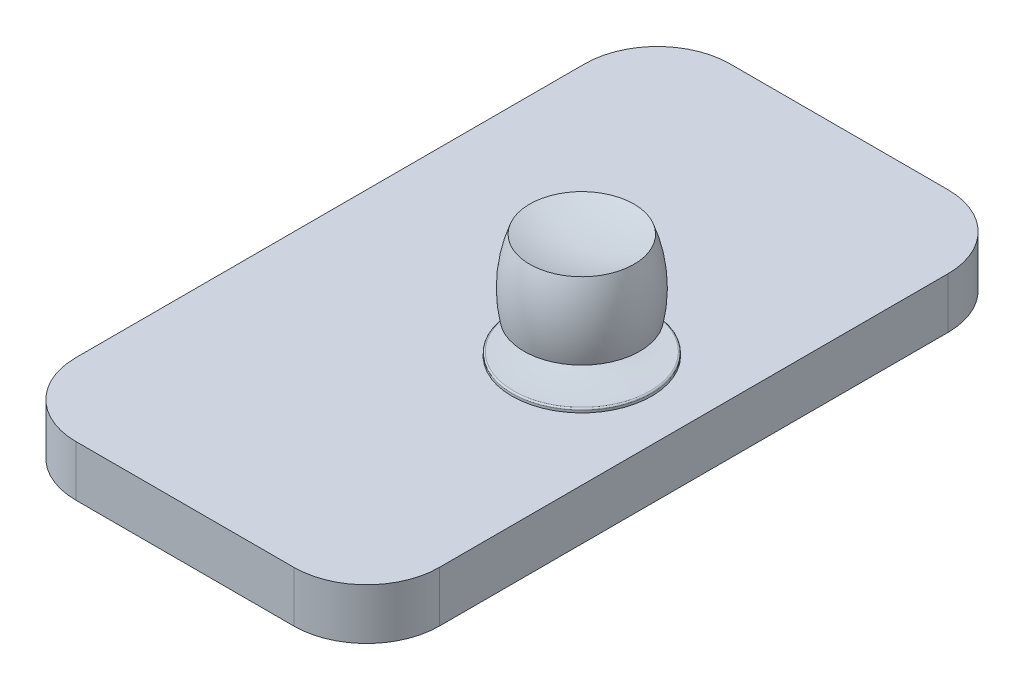
ISO-10303-21;
HEADER;
FILE_DESCRIPTION(('STEP AP214'),'2;1');
FILE_NAME('part.step','',(''),(''),'','','');
FILE_SCHEMA(('AUTOMOTIVE_DESIGN { 1 0 10303 214 1 1 1 1 }'));
ENDSEC;
DATA;
#1=APPLICATION_CONTEXT('core data for automotive mechanical design processes');
#2=APPLICATION_PROTOCOL_DEFINITION('international standard','automotive_design',2000,#1);
#3=PRODUCT_CONTEXT('',#1,'mechanical');
#4=PRODUCT('Part','Part','',(#3));
#5=PRODUCT_RELATED_PRODUCT_CATEGORY('part','',(#4));
#6=PRODUCT_DEFINITION_FORMATION('','',#4);
#7=PRODUCT_DEFINITION_CONTEXT('part definition',#1,'design');
#8=PRODUCT_DEFINITION('design','',#6,#7);
#9=PRODUCT_DEFINITION_SHAPE('','',#8);
#10=(LENGTH_UNIT() NAMED_UNIT(*) SI_UNIT(.MILLI.,.METRE.));
#11=(NAMED_UNIT(*) PLANE_ANGLE_UNIT() SI_UNIT($,.RADIAN.));
#12=(NAMED_UNIT(*) SI_UNIT($,.STERADIAN.) SOLID_ANGLE_UNIT());
#13=UNCERTAINTY_MEASURE_WITH_UNIT(LENGTH_MEASURE(1.E-05),#10,'distance_accuracy_value','');
#14=(GEOMETRIC_REPRESENTATION_CONTEXT(3) GLOBAL_UNCERTAINTY_ASSIGNED_CONTEXT((#13)) GLOBAL_UNIT_ASSIGNED_CONTEXT((#10,
#11,#12)) REPRESENTATION_CONTEXT('',''));
#15=CARTESIAN_POINT('',(0.,0.,0.));
#16=DIRECTION('',(0.,0.,1.));
#17=DIRECTION('',(1.,0.,0.));
#18=AXIS2_PLACEMENT_3D('',#15,#16,#17);
#19=CARTESIAN_POINT('',(63.5,17.78,-114.3));
#20=DIRECTION('',(-1.,0.,0.));
#21=DIRECTION('',(0.,0.,1.));
#22=AXIS2_PLACEMENT_3D('',#19,#20,#21);
#23=PLANE('',#22);
#24=DIRECTION('',(0.,0.,-1.));
#25=VECTOR('',#24,1.);
#26=CARTESIAN_POINT('',(63.5,0.,-114.3));
#27=LINE('',#26,#25);
#28=CARTESIAN_POINT('',(63.5,0.,88.9));
#29=VERTEX_POINT('',#28);
#30=CARTESIAN_POINT('',(63.5,0.,-88.9));
#31=VERTEX_POINT('',#30);
#32=EDGE_CURVE('E129',#29,#31,#27,.T.);
#33=ORIENTED_EDGE('',*,*,#32,.T.);
#34=DIRECTION('',(0.,-1.,0.));
#35=VECTOR('',#34,1.);
#36=CARTESIAN_POINT('',(63.5,17.78,-88.9));
#37=LINE('',#36,#35);
#38=CARTESIAN_POINT('',(63.5,17.78,-88.9));
#39=VERTEX_POINT('',#38);
#40=EDGE_CURVE('E43',#31,#39,#37,.F.);
#41=ORIENTED_EDGE('',*,*,#40,.T.);
#42=DIRECTION('',(0.,0.,-1.));
#43=VECTOR('',#42,1.);
#44=CARTESIAN_POINT('',(63.5,17.78,-114.3));
#45=LINE('',#44,#43);
#46=CARTESIAN_POINT('',(63.5,17.78,88.9));
#47=VERTEX_POINT('',#46);
#48=EDGE_CURVE('E130',#47,#39,#45,.T.);
#49=ORIENTED_EDGE('',*,*,#48,.F.);
#50=DIRECTION('',(0.,-1.,0.));
#51=VECTOR('',#50,1.);
#52=CARTESIAN_POINT('',(63.5,17.78,88.9));
#53=LINE('',#52,#51);
#54=EDGE_CURVE('E179',#47,#29,#53,.T.);
#55=ORIENTED_EDGE('',*,*,#54,.T.);
#56=EDGE_LOOP('',(#33,#41,#49,#55));
#57=FACE_BOUND('',#56,.T.);
#58=ADVANCED_FACE('F35',(#57),#23,.F.);
#59=CARTESIAN_POINT('',(-63.5,17.78,-114.3));
#60=DIRECTION('',(0.,0.,1.));
#61=DIRECTION('',(1.,0.,0.));
#62=AXIS2_PLACEMENT_3D('',#59,#60,#61);
#63=PLANE('',#62);
#64=DIRECTION('',(-1.,0.,0.));
#65=VECTOR('',#64,1.);
#66=CARTESIAN_POINT('',(-63.5,0.,-114.3));
#67=LINE('',#66,#65);
#68=CARTESIAN_POINT('',(38.1,0.,-114.3));
#69=VERTEX_POINT('',#68);
#70=CARTESIAN_POINT('',(-38.1,0.,-114.3));
#71=VERTEX_POINT('',#70);
#72=EDGE_CURVE('E144',#69,#71,#67,.T.);
#73=ORIENTED_EDGE('',*,*,#72,.T.);
#74=DIRECTION('',(0.,-1.,0.));
#75=VECTOR('',#74,1.);
#76=CARTESIAN_POINT('',(-38.1,17.78,-114.3));
#77=LINE('',#76,#75);
#78=CARTESIAN_POINT('',(-38.1,17.78,-114.3));
#79=VERTEX_POINT('',#78);
#80=EDGE_CURVE('E50',#71,#79,#77,.F.);
#81=ORIENTED_EDGE('',*,*,#80,.T.);
#82=DIRECTION('',(-1.,0.,0.));
#83=VECTOR('',#82,1.);
#84=CARTESIAN_POINT('',(-63.5,17.78,-114.3));
#85=LINE('',#84,#83);
#86=CARTESIAN_POINT('',(38.1,17.78,-114.3));
#87=VERTEX_POINT('',#86);
#88=EDGE_CURVE('E132',#87,#79,#85,.T.);
#89=ORIENTED_EDGE('',*,*,#88,.F.);
#90=DIRECTION('',(0.,-1.,0.));
#91=VECTOR('',#90,1.);
#92=CARTESIAN_POINT('',(38.1,17.78,-114.3));
#93=LINE('',#92,#91);
#94=EDGE_CURVE('E175',#87,#69,#93,.T.);
#95=ORIENTED_EDGE('',*,*,#94,.T.);
#96=EDGE_LOOP('',(#73,#81,#89,#95));
#97=FACE_BOUND('',#96,.T.);
#98=ADVANCED_FACE('F192',(#97),#63,.F.);
#99=CARTESIAN_POINT('',(-63.5,17.78,-114.3));
#100=DIRECTION('',(1.,0.,0.));
#101=DIRECTION('',(0.,0.,-1.));
#102=AXIS2_PLACEMENT_3D('',#99,#100,#101);
#103=PLANE('',#102);
#104=DIRECTION('',(0.,0.,1.));
#105=VECTOR('',#104,1.);
#106=CARTESIAN_POINT('',(-63.5,0.,-114.3));
#107=LINE('',#106,#105);
#108=CARTESIAN_POINT('',(-63.5,0.,-88.9));
#109=VERTEX_POINT('',#108);
#110=CARTESIAN_POINT('',(-63.5,0.,88.9));
#111=VERTEX_POINT('',#110);
#112=EDGE_CURVE('E146',#109,#111,#107,.T.);
#113=ORIENTED_EDGE('',*,*,#112,.T.);
#114=DIRECTION('',(0.,-1.,0.));
#115=VECTOR('',#114,1.);
#116=CARTESIAN_POINT('',(-63.5,17.78,88.9));
#117=LINE('',#116,#115);
#118=CARTESIAN_POINT('',(-63.5,17.78,88.9));
#119=VERTEX_POINT('',#118);
#120=EDGE_CURVE('E166',#111,#119,#117,.F.);
#121=ORIENTED_EDGE('',*,*,#120,.T.);
#122=DIRECTION('',(0.,0.,1.));
#123=VECTOR('',#122,1.);
#124=CARTESIAN_POINT('',(-63.5,17.78,-114.3));
#125=LINE('',#124,#123);
#126=CARTESIAN_POINT('',(-63.5,17.78,-88.9));
#127=VERTEX_POINT('',#126);
#128=EDGE_CURVE('E135',#127,#119,#125,.T.);
#129=ORIENTED_EDGE('',*,*,#128,.F.);
#130=DIRECTION('',(0.,-1.,0.));
#131=VECTOR('',#130,1.);
#132=CARTESIAN_POINT('',(-63.5,17.78,-88.9));
#133=LINE('',#132,#131);
#134=EDGE_CURVE('E163',#127,#109,#133,.T.);
#135=ORIENTED_EDGE('',*,*,#134,.T.);
#136=EDGE_LOOP('',(#113,#121,#129,#135));
#137=FACE_BOUND('',#136,.T.);
#138=ADVANCED_FACE('F203',(#137),#103,.F.);
#139=CARTESIAN_POINT('',(-63.5,17.78,114.3));
#140=DIRECTION('',(0.,0.,-1.));
#141=DIRECTION('',(-1.,0.,0.));
#142=AXIS2_PLACEMENT_3D('',#139,#140,#141);
#143=PLANE('',#142);
#144=DIRECTION('',(1.,0.,0.));
#145=VECTOR('',#144,1.);
#146=CARTESIAN_POINT('',(-63.5,17.78,114.3));
#147=LINE('',#146,#145);
#148=CARTESIAN_POINT('',(-38.1,17.78,114.3));
#149=VERTEX_POINT('',#148);
#150=CARTESIAN_POINT('',(38.1,17.78,114.3));
#151=VERTEX_POINT('',#150);
#152=EDGE_CURVE('E138',#149,#151,#147,.T.);
#153=ORIENTED_EDGE('',*,*,#152,.F.);
#154=DIRECTION('',(0.,-1.,0.));
#155=VECTOR('',#154,1.);
#156=CARTESIAN_POINT('',(-38.1,17.78,114.3));
#157=LINE('',#156,#155);
#158=CARTESIAN_POINT('',(-38.1,0.,114.3));
#159=VERTEX_POINT('',#158);
#160=EDGE_CURVE('E152',#149,#159,#157,.T.);
#161=ORIENTED_EDGE('',*,*,#160,.T.);
#162=DIRECTION('',(1.,0.,0.));
#163=VECTOR('',#162,1.);
#164=CARTESIAN_POINT('',(-63.5,0.,114.3));
#165=LINE('',#164,#163);
#166=CARTESIAN_POINT('',(38.1,0.,114.3));
#167=VERTEX_POINT('',#166);
#168=EDGE_CURVE('E133',#159,#167,#165,.T.);
#169=ORIENTED_EDGE('',*,*,#168,.T.);
#170=DIRECTION('',(0.,-1.,0.));
#171=VECTOR('',#170,1.);
#172=CARTESIAN_POINT('',(38.1,17.78,114.3));
#173=LINE('',#172,#171);
#174=EDGE_CURVE('E141',#167,#151,#173,.F.);
#175=ORIENTED_EDGE('',*,*,#174,.T.);
#176=EDGE_LOOP('',(#153,#161,#169,#175));
#177=FACE_BOUND('',#176,.T.);
#178=ADVANCED_FACE('F211',(#177),#143,.F.);
#179=CARTESIAN_POINT('',(0.,17.78,0.));
#180=DIRECTION('',(0.,1.,0.));
#181=DIRECTION('',(0.,0.,1.));
#182=AXIS2_PLACEMENT_3D('',#179,#180,#181);
#183=PLANE('',#182);
#184=CARTESIAN_POINT('',(24.4007110677409,17.78,0.));
#185=DIRECTION('',(0.,1.,0.));
#186=DIRECTION('',(0.,0.,1.));
#187=AXIS2_PLACEMENT_3D('',#184,#185,#186);
#188=CIRCLE('',#187,24.4007110677409);
#189=CARTESIAN_POINT('',(24.4007110677409,17.78,24.4007110677409));
#190=VERTEX_POINT('',#189);
#191=EDGE_CURVE('E115',#190,#190,#188,.T.);
#192=ORIENTED_EDGE('',*,*,#191,.F.);
#193=EDGE_LOOP('',(#192));
#194=FACE_BOUND('',#193,.T.);
#195=ORIENTED_EDGE('',*,*,#128,.T.);
#196=CARTESIAN_POINT('',(-38.1,17.78,88.9));
#197=DIRECTION('',(0.,1.,0.));
#198=DIRECTION('',(0.,0.,1.));
#199=AXIS2_PLACEMENT_3D('',#196,#197,#198);
#200=CIRCLE('',#199,25.4);
#201=EDGE_CURVE('E173',#119,#149,#200,.T.);
#202=ORIENTED_EDGE('',*,*,#201,.T.);
#203=ORIENTED_EDGE('',*,*,#152,.T.);
#204=CARTESIAN_POINT('',(38.1,17.78,88.9));
#205=DIRECTION('',(0.,1.,0.));
#206=DIRECTION('',(0.,0.,1.));
#207=AXIS2_PLACEMENT_3D('',#204,#205,#206);
#208=CIRCLE('',#207,25.4);
#209=EDGE_CURVE('E168',#151,#47,#208,.T.);
#210=ORIENTED_EDGE('',*,*,#209,.T.);
#211=ORIENTED_EDGE('',*,*,#48,.T.);
#212=CARTESIAN_POINT('',(38.1,17.78,-88.9));
#213=DIRECTION('',(0.,1.,0.));
#214=DIRECTION('',(0.,0.,1.));
#215=AXIS2_PLACEMENT_3D('',#212,#213,#214);
#216=CIRCLE('',#215,25.4);
#217=EDGE_CURVE('E57',#39,#87,#216,.T.);
#218=ORIENTED_EDGE('',*,*,#217,.T.);
#219=ORIENTED_EDGE('',*,*,#88,.T.);
#220=CARTESIAN_POINT('',(-38.1,17.78,-88.9));
#221=DIRECTION('',(0.,1.,0.));
#222=DIRECTION('',(0.,0.,1.));
#223=AXIS2_PLACEMENT_3D('',#220,#221,#222);
#224=CIRCLE('',#223,25.4);
#225=EDGE_CURVE('E171',#79,#127,#224,.T.);
#226=ORIENTED_EDGE('',*,*,#225,.T.);
#227=EDGE_LOOP('',(#195,#202,#203,#210,#211,#218,#219,#226));
#228=FACE_BOUND('',#227,.T.);
#229=ADVANCED_FACE('F187',(#194,#228),#183,.T.);
#230=CARTESIAN_POINT('',(0.,0.,0.));
#231=DIRECTION('',(0.,1.,0.));
#232=DIRECTION('',(0.,0.,1.));
#233=AXIS2_PLACEMENT_3D('',#230,#231,#232);
#234=PLANE('',#233);
#235=ORIENTED_EDGE('',*,*,#168,.F.);
#236=CARTESIAN_POINT('',(-38.1,0.,88.9));
#237=DIRECTION('',(0.,1.,0.));
#238=DIRECTION('',(0.,0.,1.));
#239=AXIS2_PLACEMENT_3D('',#236,#237,#238);
#240=CIRCLE('',#239,25.4);
#241=EDGE_CURVE('E161',#159,#111,#240,.F.);
#242=ORIENTED_EDGE('',*,*,#241,.T.);
#243=ORIENTED_EDGE('',*,*,#112,.F.);
#244=CARTESIAN_POINT('',(-38.1,0.,-88.9));
#245=DIRECTION('',(0.,1.,0.));
#246=DIRECTION('',(0.,0.,1.));
#247=AXIS2_PLACEMENT_3D('',#244,#245,#246);
#248=CIRCLE('',#247,25.4);
#249=EDGE_CURVE('E159',#109,#71,#248,.F.);
#250=ORIENTED_EDGE('',*,*,#249,.T.);
#251=ORIENTED_EDGE('',*,*,#72,.F.);
#252=CARTESIAN_POINT('',(38.1,0.,-88.9));
#253=DIRECTION('',(0.,1.,0.));
#254=DIRECTION('',(0.,0.,1.));
#255=AXIS2_PLACEMENT_3D('',#252,#253,#254);
#256=CIRCLE('',#255,25.4);
#257=EDGE_CURVE('E157',#69,#31,#256,.F.);
#258=ORIENTED_EDGE('',*,*,#257,.T.);
#259=ORIENTED_EDGE('',*,*,#32,.F.);
#260=CARTESIAN_POINT('',(38.1,0.,88.9));
#261=DIRECTION('',(0.,1.,0.));
#262=DIRECTION('',(0.,0.,1.));
#263=AXIS2_PLACEMENT_3D('',#260,#261,#262);
#264=CIRCLE('',#263,25.4);
#265=EDGE_CURVE('E155',#29,#167,#264,.F.);
#266=ORIENTED_EDGE('',*,*,#265,.T.);
#267=EDGE_LOOP('',(#235,#242,#243,#250,#251,#258,#259,#266));
#268=FACE_BOUND('',#267,.T.);
#269=ADVANCED_FACE('F195',(#268),#234,.F.);
#270=CARTESIAN_POINT('',(-38.1,17.78,88.9));
#271=DIRECTION('',(0.,-1.,0.));
#272=DIRECTION('',(0.,0.,-1.));
#273=AXIS2_PLACEMENT_3D('',#270,#271,#272);
#274=CYLINDRICAL_SURFACE('',#273,25.4);
#275=ORIENTED_EDGE('',*,*,#201,.F.);
#276=ORIENTED_EDGE('',*,*,#120,.F.);
#277=ORIENTED_EDGE('',*,*,#241,.F.);
#278=ORIENTED_EDGE('',*,*,#160,.F.);
#279=EDGE_LOOP('',(#275,#276,#277,#278));
#280=FACE_BOUND('',#279,.T.);
#281=ADVANCED_FACE('F209',(#280),#274,.T.);
#282=CARTESIAN_POINT('',(-38.1,17.78,-88.9));
#283=DIRECTION('',(0.,-1.,0.));
#284=DIRECTION('',(0.,0.,-1.));
#285=AXIS2_PLACEMENT_3D('',#282,#283,#284);
#286=CYLINDRICAL_SURFACE('',#285,25.4);
#287=ORIENTED_EDGE('',*,*,#225,.F.);
#288=ORIENTED_EDGE('',*,*,#80,.F.);
#289=ORIENTED_EDGE('',*,*,#249,.F.);
#290=ORIENTED_EDGE('',*,*,#134,.F.);
#291=EDGE_LOOP('',(#287,#288,#289,#290));
#292=FACE_BOUND('',#291,.T.);
#293=ADVANCED_FACE('F200',(#292),#286,.T.);
#294=CARTESIAN_POINT('',(38.1,17.78,-88.9));
#295=DIRECTION('',(0.,-1.,0.));
#296=DIRECTION('',(0.,0.,-1.));
#297=AXIS2_PLACEMENT_3D('',#294,#295,#296);
#298=CYLINDRICAL_SURFACE('',#297,25.4);
#299=ORIENTED_EDGE('',*,*,#217,.F.);
#300=ORIENTED_EDGE('',*,*,#40,.F.);
#301=ORIENTED_EDGE('',*,*,#257,.F.);
#302=ORIENTED_EDGE('',*,*,#94,.F.);
#303=EDGE_LOOP('',(#299,#300,#301,#302));
#304=FACE_BOUND('',#303,.T.);
#305=ADVANCED_FACE('F190',(#304),#298,.T.);
#306=CARTESIAN_POINT('',(38.1,17.78,88.9));
#307=DIRECTION('',(0.,-1.,0.));
#308=DIRECTION('',(0.,0.,-1.));
#309=AXIS2_PLACEMENT_3D('',#306,#307,#308);
#310=CYLINDRICAL_SURFACE('',#309,25.4);
#311=ORIENTED_EDGE('',*,*,#209,.F.);
#312=ORIENTED_EDGE('',*,*,#174,.F.);
#313=ORIENTED_EDGE('',*,*,#265,.F.);
#314=ORIENTED_EDGE('',*,*,#54,.F.);
#315=EDGE_LOOP('',(#311,#312,#313,#314));
#316=FACE_BOUND('',#315,.T.);
#317=ADVANCED_FACE('F37',(#316),#310,.T.);
#318=CARTESIAN_POINT('',(24.4007110677409,21.7324795093373,0.));
#319=DIRECTION('',(0.,1.,0.));
#320=DIRECTION('',(0.,0.,1.));
#321=AXIS2_PLACEMENT_3D('',#318,#319,#320);
#322=CYLINDRICAL_SURFACE('',#321,6.081313894143);
#323=CARTESIAN_POINT('',(24.4007110677409,27.5542863134869,0.));
#324=DIRECTION('',(0.,1.,0.));
#325=DIRECTION('',(0.,0.,1.));
#326=AXIS2_PLACEMENT_3D('',#323,#324,#325);
#327=CIRCLE('',#326,6.081313894143);
#328=CARTESIAN_POINT('',(24.4007110677409,27.5542863134869,6.081313894143));
#329=VERTEX_POINT('',#328);
#330=EDGE_CURVE('E11',#329,#329,#327,.T.);
#331=ORIENTED_EDGE('',*,*,#330,.F.);
#332=EDGE_LOOP('',(#331));
#333=FACE_BOUND('',#332,.T.);
#334=CARTESIAN_POINT('',(24.4007110677409,20.4537262691996,0.));
#335=DIRECTION('',(0.,1.,0.));
#336=DIRECTION('',(0.,0.,1.));
#337=AXIS2_PLACEMENT_3D('',#334,#335,#336);
#338=CIRCLE('',#337,6.081313894143);
#339=CARTESIAN_POINT('',(24.4007110677409,20.4537262691996,6.081313894143));
#340=VERTEX_POINT('',#339);
#341=EDGE_CURVE('E126',#340,#340,#338,.T.);
#342=ORIENTED_EDGE('',*,*,#341,.T.);
#343=EDGE_LOOP('',(#342));
#344=FACE_BOUND('',#343,.T.);
#345=ADVANCED_FACE('F215',(#333,#344),#322,.T.);
#346=CARTESIAN_POINT('',(24.4007110677409,109.701459402859,0.));
#347=DIRECTION('',(0.,1.,0.));
#348=DIRECTION('',(0.,0.,1.));
#349=AXIS2_PLACEMENT_3D('',#346,#347,#348);
#350=DEGENERATE_TOROIDAL_SURFACE('',#349,21.6728513983658,90.599414519314,.T.);
#351=ORIENTED_EDGE('',*,*,#341,.F.);
#352=EDGE_LOOP('',(#351));
#353=FACE_BOUND('',#352,.T.);
#354=CARTESIAN_POINT('',(24.4007110677409,19.1289418600718,0.));
#355=DIRECTION('',(0.,1.,0.));
#356=DIRECTION('',(0.,0.,1.));
#357=AXIS2_PLACEMENT_3D('',#354,#355,#356);
#358=CIRCLE('',#357,23.8803334943239);
#359=CARTESIAN_POINT('',(24.4007110677409,19.1289418600718,23.8803334943239));
#360=VERTEX_POINT('',#359);
#361=EDGE_CURVE('E123',#360,#360,#358,.T.);
#362=ORIENTED_EDGE('',*,*,#361,.T.);
#363=EDGE_LOOP('',(#362));
#364=FACE_BOUND('',#363,.T.);
#365=ADVANCED_FACE('F220',(#353,#364),#350,.F.);
#366=CARTESIAN_POINT('',(24.4007110677409,18.6210926741157,0.));
#367=DIRECTION('',(0.,1.,0.));
#368=DIRECTION('',(0.,0.,1.));
#369=AXIS2_PLACEMENT_3D('',#366,#367,#368);
#370=TOROIDAL_SURFACE('',#369,23.8927110677409,0.507999999999986);
#371=CARTESIAN_POINT('',(24.4007110677409,18.6210926741157,0.));
#372=DIRECTION('',(0.,1.,0.));
#373=DIRECTION('',(0.,0.,1.));
#374=AXIS2_PLACEMENT_3D('',#371,#372,#373);
#375=CIRCLE('',#374,24.4007110677409);
#376=CARTESIAN_POINT('',(24.4007110677409,18.6210926741157,24.4007110677409));
#377=VERTEX_POINT('',#376);
#378=EDGE_CURVE('E120',#377,#377,#375,.T.);
#379=ORIENTED_EDGE('',*,*,#378,.T.);
#380=EDGE_LOOP('',(#379));
#381=FACE_BOUND('',#380,.T.);
#382=ORIENTED_EDGE('',*,*,#361,.F.);
#383=EDGE_LOOP('',(#382));
#384=FACE_BOUND('',#383,.T.);
#385=ADVANCED_FACE('F265',(#381,#384),#370,.T.);
#386=CARTESIAN_POINT('',(24.4007110677409,21.7324795093373,0.));
#387=DIRECTION('',(0.,1.,0.));
#388=DIRECTION('',(0.,0.,1.));
#389=AXIS2_PLACEMENT_3D('',#386,#387,#388);
#390=CYLINDRICAL_SURFACE('',#389,24.4007110677409);
#391=ORIENTED_EDGE('',*,*,#378,.F.);
#392=EDGE_LOOP('',(#391));
#393=FACE_BOUND('',#392,.T.);
#394=ORIENTED_EDGE('',*,*,#191,.T.);
#395=EDGE_LOOP('',(#394));
#396=FACE_BOUND('',#395,.T.);
#397=ADVANCED_FACE('F276',(#393,#396),#390,.T.);
#398=CARTESIAN_POINT('',(24.4007110677409,82.3384653364362,0.));
#399=DIRECTION('',(0.,-1.,0.));
#400=DIRECTION('',(0.,0.,-1.));
#401=AXIS2_PLACEMENT_3D('',#398,#399,#400);
#402=DEGENERATE_TOROIDAL_SURFACE('',#401,6.5073224646575,54.7858353456504,.T.);
#403=ORIENTED_EDGE('',*,*,#330,.T.);
#404=EDGE_LOOP('',(#403));
#405=FACE_BOUND('',#404,.T.);
#406=CARTESIAN_POINT('',(24.4007110677409,29.3031246131212,0.));
#407=DIRECTION('',(0.,-1.,0.));
#408=DIRECTION('',(0.,0.,-1.));
#409=AXIS2_PLACEMENT_3D('',#406,#407,#408);
#410=CIRCLE('',#409,20.2456043398628);
#411=CARTESIAN_POINT('',(24.4007110677409,29.3031246131212,-20.2456043398628));
#412=VERTEX_POINT('',#411);
#413=EDGE_CURVE('E112',#412,#412,#410,.T.);
#414=ORIENTED_EDGE('',*,*,#413,.T.);
#415=EDGE_LOOP('',(#414));
#416=FACE_BOUND('',#415,.T.);
#417=ADVANCED_FACE('F286',(#405,#416),#402,.T.);
#418=CARTESIAN_POINT('',(24.4007110677409,38.3875445979562,0.));
#419=DIRECTION('',(0.,-1.,0.));
#420=DIRECTION('',(0.,0.,-1.));
#421=AXIS2_PLACEMENT_3D('',#418,#419,#420);
#422=DEGENERATE_TOROIDAL_SURFACE('',#421,25.7291732358867,46.863705141618,.F.);
#423=CARTESIAN_POINT('',(24.4007110677409,54.6300254907749,0.));
#424=DIRECTION('',(0.,-1.,0.));
#425=DIRECTION('',(0.,0.,-1.));
#426=AXIS2_PLACEMENT_3D('',#423,#424,#425);
#427=CIRCLE('',#426,18.2297698138152);
#428=CARTESIAN_POINT('',(24.4007110677409,54.6300254907749,-18.2297698138152));
#429=VERTEX_POINT('',#428);
#430=EDGE_CURVE('E110',#429,#429,#427,.T.);
#431=ORIENTED_EDGE('',*,*,#430,.T.);
#432=EDGE_LOOP('',(#431));
#433=FACE_BOUND('',#432,.T.);
#434=ORIENTED_EDGE('',*,*,#413,.F.);
#435=EDGE_LOOP('',(#434));
#436=FACE_BOUND('',#435,.T.);
#437=ADVANCED_FACE('F106',(#433,#436),#422,.F.);
#438=CARTESIAN_POINT('',(24.4007110677409,114.358056520685,-0.658539836058403));
#439=DIRECTION('',(-1.,0.,0.));
#440=DIRECTION('',(0.,0.,-1.));
#441=AXIS2_PLACEMENT_3D('',#438,#439,#440);
#442=CIRCLE('',#441,62.2590219457477);
#443=TRIMMED_CURVE('',#442,(PARAMETER_VALUE(-1.5813739442368)),
(PARAMETER_VALUE(1.5813739442368)),.T.,.PARAMETER.);
#444=CARTESIAN_POINT('',(24.4007110677409,114.358056520685,0.));
#445=DIRECTION('',(0.,-1.,0.));
#446=AXIS1_PLACEMENT('',#444,#445);
#447=SURFACE_OF_REVOLUTION('',#443,#446);
#448=CARTESIAN_POINT('',(24.4007110677409,52.1025174986393,0.));
#449=VERTEX_POINT('',#448);
#450=VERTEX_LOOP('',#449);
#451=FACE_BOUND('',#450,.T.);
#452=ORIENTED_EDGE('',*,*,#430,.F.);
#453=EDGE_LOOP('',(#452));
#454=FACE_BOUND('',#453,.T.);
#455=ADVANCED_FACE('F103',(#451,#454),#447,.F.);
#456=CLOSED_SHELL('',(#58,#98,#138,#178,#229,#269,#281,#293,#305,#317,#345,#365,#385,#397,#417,
#437,#455));
#457=MANIFOLD_SOLID_BREP('B2',#456);
#458=ADVANCED_BREP_SHAPE_REPRESENTATION('',(#18,#457),#14);
#459=SHAPE_DEFINITION_REPRESENTATION(#9,#458);
ENDSEC;
END-ISO-10303-21;
